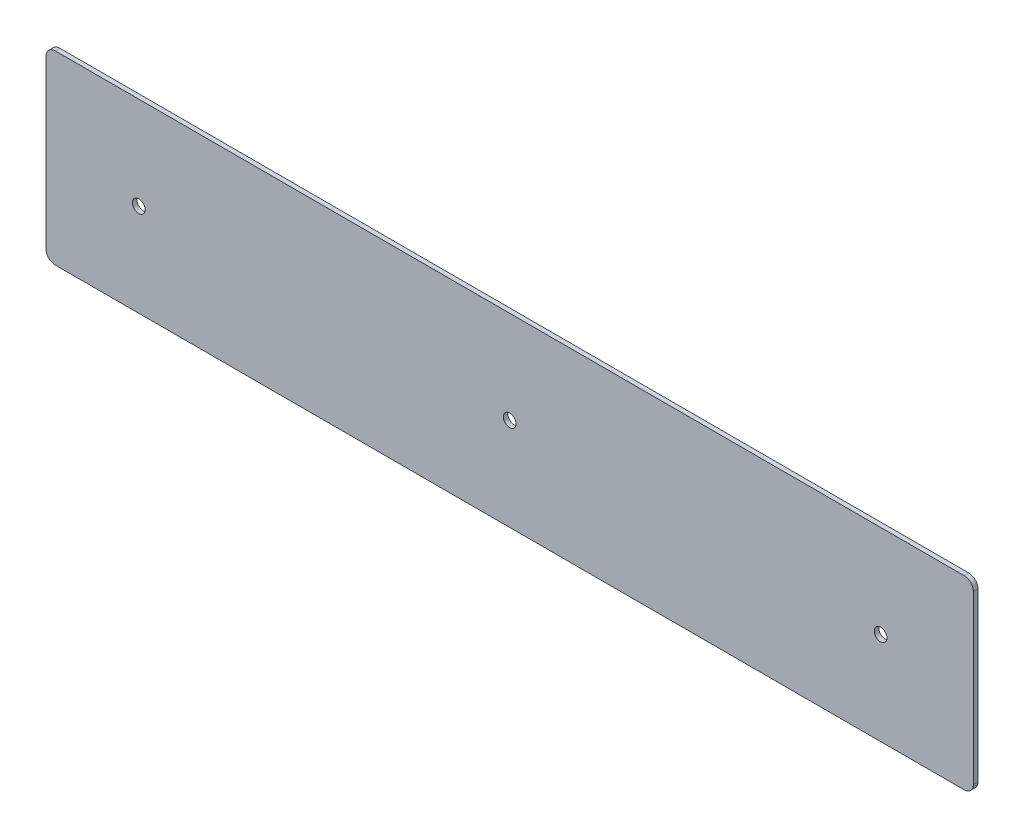
ISO-10303-21;
HEADER;
FILE_DESCRIPTION(('STEP AP214'),'2;1');
FILE_NAME('part.step','',(''),(''),'','','');
FILE_SCHEMA(('AUTOMOTIVE_DESIGN { 1 0 10303 214 1 1 1 1 }'));
ENDSEC;
DATA;
#1=APPLICATION_CONTEXT('core data for automotive mechanical design processes');
#2=APPLICATION_PROTOCOL_DEFINITION('international standard','automotive_design',2000,#1);
#3=PRODUCT_CONTEXT('',#1,'mechanical');
#4=PRODUCT('Part','Part','',(#3));
#5=PRODUCT_RELATED_PRODUCT_CATEGORY('part','',(#4));
#6=PRODUCT_DEFINITION_FORMATION('','',#4);
#7=PRODUCT_DEFINITION_CONTEXT('part definition',#1,'design');
#8=PRODUCT_DEFINITION('design','',#6,#7);
#9=PRODUCT_DEFINITION_SHAPE('','',#8);
#10=(LENGTH_UNIT() NAMED_UNIT(*) SI_UNIT(.MILLI.,.METRE.));
#11=(NAMED_UNIT(*) PLANE_ANGLE_UNIT() SI_UNIT($,.RADIAN.));
#12=(NAMED_UNIT(*) SI_UNIT($,.STERADIAN.) SOLID_ANGLE_UNIT());
#13=UNCERTAINTY_MEASURE_WITH_UNIT(LENGTH_MEASURE(1.E-05),#10,'distance_accuracy_value','');
#14=(GEOMETRIC_REPRESENTATION_CONTEXT(3) GLOBAL_UNCERTAINTY_ASSIGNED_CONTEXT((#13)) GLOBAL_UNIT_ASSIGNED_CONTEXT((#10,
#11,#12)) REPRESENTATION_CONTEXT('',''));
#15=CARTESIAN_POINT('',(0.,0.,0.));
#16=DIRECTION('',(0.,0.,1.));
#17=DIRECTION('',(1.,0.,0.));
#18=AXIS2_PLACEMENT_3D('',#15,#16,#17);
#19=CARTESIAN_POINT('',(0.,0.,0.79375));
#20=DIRECTION('',(0.,0.,1.));
#21=DIRECTION('',(1.,0.,0.));
#22=AXIS2_PLACEMENT_3D('',#19,#20,#21);
#23=PLANE('',#22);
#24=CARTESIAN_POINT('',(127.,0.,0.79375));
#25=DIRECTION('',(0.,0.,1.));
#26=DIRECTION('',(1.,0.,0.));
#27=AXIS2_PLACEMENT_3D('',#24,#25,#26);
#28=CIRCLE('',#27,2.1828125);
#29=CARTESIAN_POINT('',(129.1828125,0.,0.79375));
#30=VERTEX_POINT('',#29);
#31=EDGE_CURVE('E200',#30,#30,#28,.T.);
#32=ORIENTED_EDGE('',*,*,#31,.F.);
#33=EDGE_LOOP('',(#32));
#34=FACE_BOUND('',#33,.T.);
#35=DIRECTION('',(0.,-1.,0.));
#36=VECTOR('',#35,1.);
#37=CARTESIAN_POINT('',(-158.75,31.75,0.79375));
#38=LINE('',#37,#36);
#39=CARTESIAN_POINT('',(-158.75,28.575,0.79375));
#40=VERTEX_POINT('',#39);
#41=CARTESIAN_POINT('',(-158.75,-28.575,0.79375));
#42=VERTEX_POINT('',#41);
#43=EDGE_CURVE('E193',#40,#42,#38,.T.);
#44=ORIENTED_EDGE('',*,*,#43,.T.);
#45=CARTESIAN_POINT('',(-155.575,-28.575,0.79375));
#46=DIRECTION('',(0.,0.,1.));
#47=DIRECTION('',(1.,0.,0.));
#48=AXIS2_PLACEMENT_3D('',#45,#46,#47);
#49=CIRCLE('',#48,3.175);
#50=CARTESIAN_POINT('',(-155.575,-31.75,0.79375));
#51=VERTEX_POINT('',#50);
#52=EDGE_CURVE('E168',#42,#51,#49,.T.);
#53=ORIENTED_EDGE('',*,*,#52,.T.);
#54=DIRECTION('',(1.,0.,0.));
#55=VECTOR('',#54,1.);
#56=CARTESIAN_POINT('',(-158.75,-31.75,0.79375));
#57=LINE('',#56,#55);
#58=CARTESIAN_POINT('',(155.575,-31.75,0.79375));
#59=VERTEX_POINT('',#58);
#60=EDGE_CURVE('E135',#51,#59,#57,.T.);
#61=ORIENTED_EDGE('',*,*,#60,.T.);
#62=CARTESIAN_POINT('',(155.575,-28.575,0.79375));
#63=DIRECTION('',(0.,0.,1.));
#64=DIRECTION('',(1.,0.,0.));
#65=AXIS2_PLACEMENT_3D('',#62,#63,#64);
#66=CIRCLE('',#65,3.175);
#67=CARTESIAN_POINT('',(158.75,-28.575,0.79375));
#68=VERTEX_POINT('',#67);
#69=EDGE_CURVE('E164',#59,#68,#66,.T.);
#70=ORIENTED_EDGE('',*,*,#69,.T.);
#71=DIRECTION('',(0.,1.,0.));
#72=VECTOR('',#71,1.);
#73=CARTESIAN_POINT('',(158.75,31.75,0.79375));
#74=LINE('',#73,#72);
#75=CARTESIAN_POINT('',(158.75,28.575,0.79375));
#76=VERTEX_POINT('',#75);
#77=EDGE_CURVE('E145',#68,#76,#74,.T.);
#78=ORIENTED_EDGE('',*,*,#77,.T.);
#79=CARTESIAN_POINT('',(155.575,28.575,0.79375));
#80=DIRECTION('',(0.,0.,1.));
#81=DIRECTION('',(1.,0.,0.));
#82=AXIS2_PLACEMENT_3D('',#79,#80,#81);
#83=CIRCLE('',#82,3.175);
#84=CARTESIAN_POINT('',(155.575,31.75,0.79375));
#85=VERTEX_POINT('',#84);
#86=EDGE_CURVE('E65',#76,#85,#83,.T.);
#87=ORIENTED_EDGE('',*,*,#86,.T.);
#88=DIRECTION('',(-1.,0.,0.));
#89=VECTOR('',#88,1.);
#90=CARTESIAN_POINT('',(-158.75,31.75,0.79375));
#91=LINE('',#90,#89);
#92=CARTESIAN_POINT('',(-155.575,31.75,0.79375));
#93=VERTEX_POINT('',#92);
#94=EDGE_CURVE('E148',#85,#93,#91,.T.);
#95=ORIENTED_EDGE('',*,*,#94,.T.);
#96=CARTESIAN_POINT('',(-155.575,28.575,0.79375));
#97=DIRECTION('',(0.,0.,1.));
#98=DIRECTION('',(1.,0.,0.));
#99=AXIS2_PLACEMENT_3D('',#96,#97,#98);
#100=CIRCLE('',#99,3.175);
#101=EDGE_CURVE('E166',#93,#40,#100,.T.);
#102=ORIENTED_EDGE('',*,*,#101,.T.);
#103=EDGE_LOOP('',(#44,#53,#61,#70,#78,#87,#95,#102));
#104=FACE_BOUND('',#103,.T.);
#105=CARTESIAN_POINT('',(0.,0.,0.79375));
#106=DIRECTION('',(0.,0.,1.));
#107=DIRECTION('',(1.,0.,0.));
#108=AXIS2_PLACEMENT_3D('',#105,#106,#107);
#109=CIRCLE('',#108,2.1828125);
#110=CARTESIAN_POINT('',(2.18281249999992,0.,0.79375));
#111=VERTEX_POINT('',#110);
#112=EDGE_CURVE('E188',#111,#111,#109,.T.);
#113=ORIENTED_EDGE('',*,*,#112,.F.);
#114=EDGE_LOOP('',(#113));
#115=FACE_BOUND('',#114,.T.);
#116=CARTESIAN_POINT('',(-127.,0.,0.79375));
#117=DIRECTION('',(0.,0.,1.));
#118=DIRECTION('',(1.,0.,0.));
#119=AXIS2_PLACEMENT_3D('',#116,#117,#118);
#120=CIRCLE('',#119,2.1828125);
#121=CARTESIAN_POINT('',(-124.8171875,0.,0.79375));
#122=VERTEX_POINT('',#121);
#123=EDGE_CURVE('E206',#122,#122,#120,.T.);
#124=ORIENTED_EDGE('',*,*,#123,.F.);
#125=EDGE_LOOP('',(#124));
#126=FACE_BOUND('',#125,.T.);
#127=ADVANCED_FACE('F43',(#34,#104,#115,#126),#23,.T.);
#128=CARTESIAN_POINT('',(0.,0.,-0.79375));
#129=DIRECTION('',(0.,0.,1.));
#130=DIRECTION('',(1.,0.,0.));
#131=AXIS2_PLACEMENT_3D('',#128,#129,#130);
#132=PLANE('',#131);
#133=DIRECTION('',(1.,0.,0.));
#134=VECTOR('',#133,1.);
#135=CARTESIAN_POINT('',(-158.75,-31.75,-0.79375));
#136=LINE('',#135,#134);
#137=CARTESIAN_POINT('',(-155.575,-31.75,-0.79375));
#138=VERTEX_POINT('',#137);
#139=CARTESIAN_POINT('',(155.575,-31.75,-0.79375));
#140=VERTEX_POINT('',#139);
#141=EDGE_CURVE('E132',#138,#140,#136,.T.);
#142=ORIENTED_EDGE('',*,*,#141,.F.);
#143=CARTESIAN_POINT('',(-155.575,-28.575,-0.79375));
#144=DIRECTION('',(0.,0.,1.));
#145=DIRECTION('',(1.,0.,0.));
#146=AXIS2_PLACEMENT_3D('',#143,#144,#145);
#147=CIRCLE('',#146,3.175);
#148=CARTESIAN_POINT('',(-158.75,-28.575,-0.79375));
#149=VERTEX_POINT('',#148);
#150=EDGE_CURVE('E114',#138,#149,#147,.F.);
#151=ORIENTED_EDGE('',*,*,#150,.T.);
#152=DIRECTION('',(0.,-1.,0.));
#153=VECTOR('',#152,1.);
#154=CARTESIAN_POINT('',(-158.75,31.75,-0.79375));
#155=LINE('',#154,#153);
#156=CARTESIAN_POINT('',(-158.75,28.575,-0.79375));
#157=VERTEX_POINT('',#156);
#158=EDGE_CURVE('E146',#157,#149,#155,.T.);
#159=ORIENTED_EDGE('',*,*,#158,.F.);
#160=CARTESIAN_POINT('',(-155.575,28.575,-0.79375));
#161=DIRECTION('',(0.,0.,1.));
#162=DIRECTION('',(1.,0.,0.));
#163=AXIS2_PLACEMENT_3D('',#160,#161,#162);
#164=CIRCLE('',#163,3.175);
#165=CARTESIAN_POINT('',(-155.575,31.75,-0.79375));
#166=VERTEX_POINT('',#165);
#167=EDGE_CURVE('E126',#157,#166,#164,.F.);
#168=ORIENTED_EDGE('',*,*,#167,.T.);
#169=DIRECTION('',(-1.,0.,0.));
#170=VECTOR('',#169,1.);
#171=CARTESIAN_POINT('',(-158.75,31.75,-0.79375));
#172=LINE('',#171,#170);
#173=CARTESIAN_POINT('',(155.575,31.75,-0.79375));
#174=VERTEX_POINT('',#173);
#175=EDGE_CURVE('E151',#174,#166,#172,.T.);
#176=ORIENTED_EDGE('',*,*,#175,.F.);
#177=CARTESIAN_POINT('',(155.575,28.575,-0.79375));
#178=DIRECTION('',(0.,0.,1.));
#179=DIRECTION('',(1.,0.,0.));
#180=AXIS2_PLACEMENT_3D('',#177,#178,#179);
#181=CIRCLE('',#180,3.175);
#182=CARTESIAN_POINT('',(158.75,28.575,-0.79375));
#183=VERTEX_POINT('',#182);
#184=EDGE_CURVE('E137',#174,#183,#181,.F.);
#185=ORIENTED_EDGE('',*,*,#184,.T.);
#186=DIRECTION('',(0.,1.,0.));
#187=VECTOR('',#186,1.);
#188=CARTESIAN_POINT('',(158.75,31.75,-0.79375));
#189=LINE('',#188,#187);
#190=CARTESIAN_POINT('',(158.75,-28.575,-0.79375));
#191=VERTEX_POINT('',#190);
#192=EDGE_CURVE('E180',#191,#183,#189,.T.);
#193=ORIENTED_EDGE('',*,*,#192,.F.);
#194=CARTESIAN_POINT('',(155.575,-28.575,-0.79375));
#195=DIRECTION('',(0.,0.,1.));
#196=DIRECTION('',(1.,0.,0.));
#197=AXIS2_PLACEMENT_3D('',#194,#195,#196);
#198=CIRCLE('',#197,3.175);
#199=EDGE_CURVE('E143',#191,#140,#198,.F.);
#200=ORIENTED_EDGE('',*,*,#199,.T.);
#201=EDGE_LOOP('',(#142,#151,#159,#168,#176,#185,#193,#200));
#202=FACE_BOUND('',#201,.T.);
#203=CARTESIAN_POINT('',(0.,0.,-0.79375));
#204=DIRECTION('',(0.,0.,1.));
#205=DIRECTION('',(1.,0.,0.));
#206=AXIS2_PLACEMENT_3D('',#203,#204,#205);
#207=CIRCLE('',#206,2.1828125);
#208=CARTESIAN_POINT('',(2.18281249999992,0.,-0.79375));
#209=VERTEX_POINT('',#208);
#210=EDGE_CURVE('E197',#209,#209,#207,.T.);
#211=ORIENTED_EDGE('',*,*,#210,.T.);
#212=EDGE_LOOP('',(#211));
#213=FACE_BOUND('',#212,.T.);
#214=CARTESIAN_POINT('',(127.,0.,-0.79375));
#215=DIRECTION('',(0.,0.,1.));
#216=DIRECTION('',(1.,0.,0.));
#217=AXIS2_PLACEMENT_3D('',#214,#215,#216);
#218=CIRCLE('',#217,2.1828125);
#219=CARTESIAN_POINT('',(129.1828125,0.,-0.79375));
#220=VERTEX_POINT('',#219);
#221=EDGE_CURVE('E203',#220,#220,#218,.T.);
#222=ORIENTED_EDGE('',*,*,#221,.T.);
#223=EDGE_LOOP('',(#222));
#224=FACE_BOUND('',#223,.T.);
#225=CARTESIAN_POINT('',(-127.,0.,-0.79375));
#226=DIRECTION('',(0.,0.,1.));
#227=DIRECTION('',(1.,0.,0.));
#228=AXIS2_PLACEMENT_3D('',#225,#226,#227);
#229=CIRCLE('',#228,2.1828125);
#230=CARTESIAN_POINT('',(-124.8171875,0.,-0.79375));
#231=VERTEX_POINT('',#230);
#232=EDGE_CURVE('E209',#231,#231,#229,.T.);
#233=ORIENTED_EDGE('',*,*,#232,.T.);
#234=EDGE_LOOP('',(#233));
#235=FACE_BOUND('',#234,.T.);
#236=ADVANCED_FACE('F140',(#202,#213,#224,#235),#132,.F.);
#237=CARTESIAN_POINT('',(158.75,31.75,0.79375));
#238=DIRECTION('',(-1.,0.,0.));
#239=DIRECTION('',(0.,0.,1.));
#240=AXIS2_PLACEMENT_3D('',#237,#238,#239);
#241=PLANE('',#240);
#242=ORIENTED_EDGE('',*,*,#77,.F.);
#243=DIRECTION('',(0.,0.,-1.));
#244=VECTOR('',#243,1.);
#245=CARTESIAN_POINT('',(158.75,-28.575,0.79375));
#246=LINE('',#245,#244);
#247=EDGE_CURVE('E11',#68,#191,#246,.T.);
#248=ORIENTED_EDGE('',*,*,#247,.T.);
#249=ORIENTED_EDGE('',*,*,#192,.T.);
#250=DIRECTION('',(0.,0.,-1.));
#251=VECTOR('',#250,1.);
#252=CARTESIAN_POINT('',(158.75,28.575,0.79375));
#253=LINE('',#252,#251);
#254=EDGE_CURVE('E51',#183,#76,#253,.F.);
#255=ORIENTED_EDGE('',*,*,#254,.T.);
#256=EDGE_LOOP('',(#242,#248,#249,#255));
#257=FACE_BOUND('',#256,.T.);
#258=ADVANCED_FACE('F178',(#257),#241,.F.);
#259=CARTESIAN_POINT('',(-158.75,31.75,0.79375));
#260=DIRECTION('',(0.,-1.,0.));
#261=DIRECTION('',(0.,0.,-1.));
#262=AXIS2_PLACEMENT_3D('',#259,#260,#261);
#263=PLANE('',#262);
#264=ORIENTED_EDGE('',*,*,#175,.T.);
#265=DIRECTION('',(0.,0.,-1.));
#266=VECTOR('',#265,1.);
#267=CARTESIAN_POINT('',(-155.575,31.75,0.79375));
#268=LINE('',#267,#266);
#269=EDGE_CURVE('E58',#166,#93,#268,.F.);
#270=ORIENTED_EDGE('',*,*,#269,.T.);
#271=ORIENTED_EDGE('',*,*,#94,.F.);
#272=DIRECTION('',(0.,0.,-1.));
#273=VECTOR('',#272,1.);
#274=CARTESIAN_POINT('',(155.575,31.75,0.79375));
#275=LINE('',#274,#273);
#276=EDGE_CURVE('E171',#85,#174,#275,.T.);
#277=ORIENTED_EDGE('',*,*,#276,.T.);
#278=EDGE_LOOP('',(#264,#270,#271,#277));
#279=FACE_BOUND('',#278,.T.);
#280=ADVANCED_FACE('F187',(#279),#263,.F.);
#281=CARTESIAN_POINT('',(-158.75,31.75,0.79375));
#282=DIRECTION('',(1.,0.,0.));
#283=DIRECTION('',(0.,0.,-1.));
#284=AXIS2_PLACEMENT_3D('',#281,#282,#283);
#285=PLANE('',#284);
#286=ORIENTED_EDGE('',*,*,#158,.T.);
#287=DIRECTION('',(0.,0.,-1.));
#288=VECTOR('',#287,1.);
#289=CARTESIAN_POINT('',(-158.75,-28.575,0.79375));
#290=LINE('',#289,#288);
#291=EDGE_CURVE('E119',#149,#42,#290,.F.);
#292=ORIENTED_EDGE('',*,*,#291,.T.);
#293=ORIENTED_EDGE('',*,*,#43,.F.);
#294=DIRECTION('',(0.,0.,-1.));
#295=VECTOR('',#294,1.);
#296=CARTESIAN_POINT('',(-158.75,28.575,0.79375));
#297=LINE('',#296,#295);
#298=EDGE_CURVE('E125',#40,#157,#297,.T.);
#299=ORIENTED_EDGE('',*,*,#298,.T.);
#300=EDGE_LOOP('',(#286,#292,#293,#299));
#301=FACE_BOUND('',#300,.T.);
#302=ADVANCED_FACE('F232',(#301),#285,.F.);
#303=CARTESIAN_POINT('',(-158.75,-31.75,0.79375));
#304=DIRECTION('',(0.,1.,0.));
#305=DIRECTION('',(0.,0.,1.));
#306=AXIS2_PLACEMENT_3D('',#303,#304,#305);
#307=PLANE('',#306);
#308=ORIENTED_EDGE('',*,*,#60,.F.);
#309=DIRECTION('',(0.,0.,-1.));
#310=VECTOR('',#309,1.);
#311=CARTESIAN_POINT('',(-155.575,-31.75,0.79375));
#312=LINE('',#311,#310);
#313=EDGE_CURVE('E118',#51,#138,#312,.T.);
#314=ORIENTED_EDGE('',*,*,#313,.T.);
#315=ORIENTED_EDGE('',*,*,#141,.T.);
#316=DIRECTION('',(0.,0.,-1.));
#317=VECTOR('',#316,1.);
#318=CARTESIAN_POINT('',(155.575,-31.75,0.79375));
#319=LINE('',#318,#317);
#320=EDGE_CURVE('E138',#140,#59,#319,.F.);
#321=ORIENTED_EDGE('',*,*,#320,.T.);
#322=EDGE_LOOP('',(#308,#314,#315,#321));
#323=FACE_BOUND('',#322,.T.);
#324=ADVANCED_FACE('F131',(#323),#307,.F.);
#325=CARTESIAN_POINT('',(0.,0.,0.79375));
#326=DIRECTION('',(0.,0.,-1.));
#327=DIRECTION('',(-1.,0.,0.));
#328=AXIS2_PLACEMENT_3D('',#325,#326,#327);
#329=CYLINDRICAL_SURFACE('',#328,2.1828125);
#330=ORIENTED_EDGE('',*,*,#112,.T.);
#331=EDGE_LOOP('',(#330));
#332=FACE_BOUND('',#331,.T.);
#333=ORIENTED_EDGE('',*,*,#210,.F.);
#334=EDGE_LOOP('',(#333));
#335=FACE_BOUND('',#334,.T.);
#336=ADVANCED_FACE('F227',(#332,#335),#329,.F.);
#337=CARTESIAN_POINT('',(127.,0.,0.79375));
#338=DIRECTION('',(0.,0.,-1.));
#339=DIRECTION('',(-1.,0.,0.));
#340=AXIS2_PLACEMENT_3D('',#337,#338,#339);
#341=CYLINDRICAL_SURFACE('',#340,2.1828125);
#342=ORIENTED_EDGE('',*,*,#31,.T.);
#343=EDGE_LOOP('',(#342));
#344=FACE_BOUND('',#343,.T.);
#345=ORIENTED_EDGE('',*,*,#221,.F.);
#346=EDGE_LOOP('',(#345));
#347=FACE_BOUND('',#346,.T.);
#348=ADVANCED_FACE('F318',(#344,#347),#341,.F.);
#349=CARTESIAN_POINT('',(-127.,0.,0.79375));
#350=DIRECTION('',(0.,0.,-1.));
#351=DIRECTION('',(-1.,0.,0.));
#352=AXIS2_PLACEMENT_3D('',#349,#350,#351);
#353=CYLINDRICAL_SURFACE('',#352,2.1828125);
#354=ORIENTED_EDGE('',*,*,#123,.T.);
#355=EDGE_LOOP('',(#354));
#356=FACE_BOUND('',#355,.T.);
#357=ORIENTED_EDGE('',*,*,#232,.F.);
#358=EDGE_LOOP('',(#357));
#359=FACE_BOUND('',#358,.T.);
#360=ADVANCED_FACE('F215',(#356,#359),#353,.F.);
#361=CARTESIAN_POINT('',(-155.575,-28.575,0.79375));
#362=DIRECTION('',(0.,0.,-1.));
#363=DIRECTION('',(-1.,0.,0.));
#364=AXIS2_PLACEMENT_3D('',#361,#362,#363);
#365=CYLINDRICAL_SURFACE('',#364,3.175);
#366=ORIENTED_EDGE('',*,*,#52,.F.);
#367=ORIENTED_EDGE('',*,*,#291,.F.);
#368=ORIENTED_EDGE('',*,*,#150,.F.);
#369=ORIENTED_EDGE('',*,*,#313,.F.);
#370=EDGE_LOOP('',(#366,#367,#368,#369));
#371=FACE_BOUND('',#370,.T.);
#372=ADVANCED_FACE('F117',(#371),#365,.T.);
#373=CARTESIAN_POINT('',(-155.575,28.575,0.79375));
#374=DIRECTION('',(0.,0.,-1.));
#375=DIRECTION('',(-1.,0.,0.));
#376=AXIS2_PLACEMENT_3D('',#373,#374,#375);
#377=CYLINDRICAL_SURFACE('',#376,3.175);
#378=ORIENTED_EDGE('',*,*,#101,.F.);
#379=ORIENTED_EDGE('',*,*,#269,.F.);
#380=ORIENTED_EDGE('',*,*,#167,.F.);
#381=ORIENTED_EDGE('',*,*,#298,.F.);
#382=EDGE_LOOP('',(#378,#379,#380,#381));
#383=FACE_BOUND('',#382,.T.);
#384=ADVANCED_FACE('F242',(#383),#377,.T.);
#385=CARTESIAN_POINT('',(155.575,-28.575,0.79375));
#386=DIRECTION('',(0.,0.,-1.));
#387=DIRECTION('',(-1.,0.,0.));
#388=AXIS2_PLACEMENT_3D('',#385,#386,#387);
#389=CYLINDRICAL_SURFACE('',#388,3.175);
#390=ORIENTED_EDGE('',*,*,#69,.F.);
#391=ORIENTED_EDGE('',*,*,#320,.F.);
#392=ORIENTED_EDGE('',*,*,#199,.F.);
#393=ORIENTED_EDGE('',*,*,#247,.F.);
#394=EDGE_LOOP('',(#390,#391,#392,#393));
#395=FACE_BOUND('',#394,.T.);
#396=ADVANCED_FACE('F244',(#395),#389,.T.);
#397=CARTESIAN_POINT('',(155.575,28.575,0.79375));
#398=DIRECTION('',(0.,0.,-1.));
#399=DIRECTION('',(-1.,0.,0.));
#400=AXIS2_PLACEMENT_3D('',#397,#398,#399);
#401=CYLINDRICAL_SURFACE('',#400,3.175);
#402=ORIENTED_EDGE('',*,*,#86,.F.);
#403=ORIENTED_EDGE('',*,*,#254,.F.);
#404=ORIENTED_EDGE('',*,*,#184,.F.);
#405=ORIENTED_EDGE('',*,*,#276,.F.);
#406=EDGE_LOOP('',(#402,#403,#404,#405));
#407=FACE_BOUND('',#406,.T.);
#408=ADVANCED_FACE('F45',(#407),#401,.T.);
#409=CLOSED_SHELL('',(#127,#236,#258,#280,#302,#324,#336,#348,#360,#372,#384,#396,#408));
#410=MANIFOLD_SOLID_BREP('B2',#409);
#411=ADVANCED_BREP_SHAPE_REPRESENTATION('',(#18,#410),#14);
#412=SHAPE_DEFINITION_REPRESENTATION(#9,#411);
ENDSEC;
END-ISO-10303-21;
